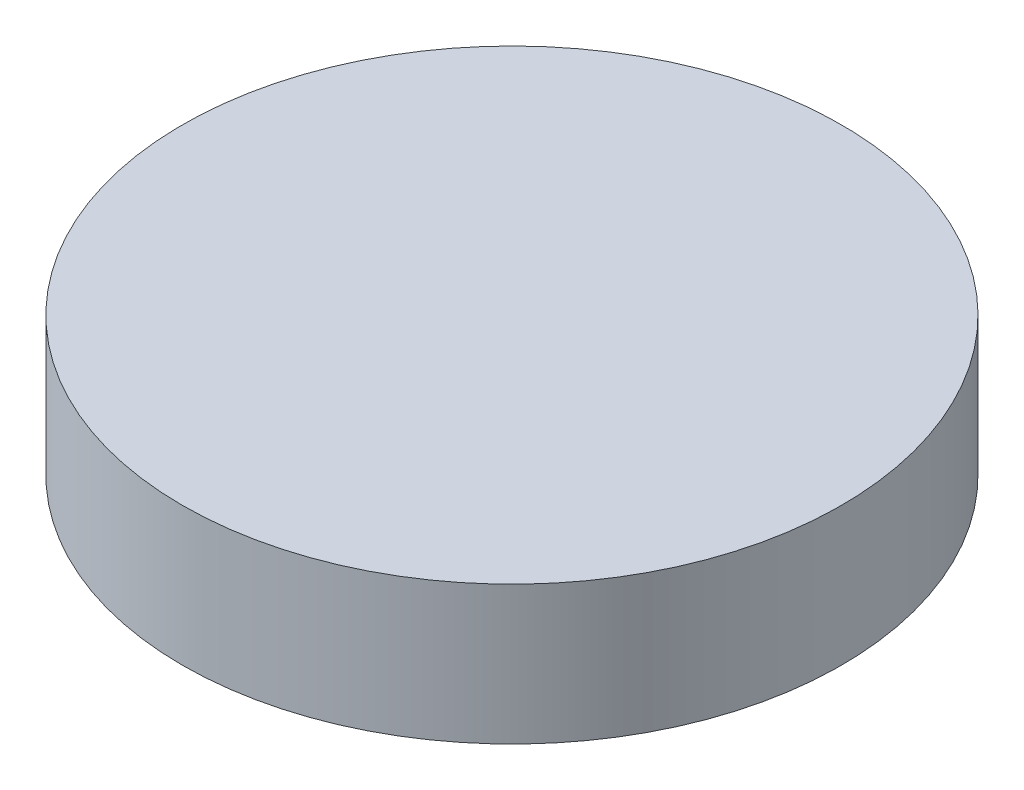
ISO-10303-21;
HEADER;
FILE_DESCRIPTION(('STEP AP214'),'2;1');
FILE_NAME('part.step','',(''),(''),'','','');
FILE_SCHEMA(('AUTOMOTIVE_DESIGN { 1 0 10303 214 1 1 1 1 }'));
ENDSEC;
DATA;
#1=APPLICATION_CONTEXT('core data for automotive mechanical design processes');
#2=APPLICATION_PROTOCOL_DEFINITION('international standard','automotive_design',2000,#1);
#3=PRODUCT_CONTEXT('',#1,'mechanical');
#4=PRODUCT('Part','Part','',(#3));
#5=PRODUCT_RELATED_PRODUCT_CATEGORY('part','',(#4));
#6=PRODUCT_DEFINITION_FORMATION('','',#4);
#7=PRODUCT_DEFINITION_CONTEXT('part definition',#1,'design');
#8=PRODUCT_DEFINITION('design','',#6,#7);
#9=PRODUCT_DEFINITION_SHAPE('','',#8);
#10=(LENGTH_UNIT() NAMED_UNIT(*) SI_UNIT(.MILLI.,.METRE.));
#11=(NAMED_UNIT(*) PLANE_ANGLE_UNIT() SI_UNIT($,.RADIAN.));
#12=(NAMED_UNIT(*) SI_UNIT($,.STERADIAN.) SOLID_ANGLE_UNIT());
#13=UNCERTAINTY_MEASURE_WITH_UNIT(LENGTH_MEASURE(1.E-05),#10,'distance_accuracy_value','');
#14=(GEOMETRIC_REPRESENTATION_CONTEXT(3) GLOBAL_UNCERTAINTY_ASSIGNED_CONTEXT((#13)) GLOBAL_UNIT_ASSIGNED_CONTEXT((#10,
#11,#12)) REPRESENTATION_CONTEXT('',''));
#15=CARTESIAN_POINT('',(0.,0.,0.));
#16=DIRECTION('',(0.,0.,1.));
#17=DIRECTION('',(1.,0.,0.));
#18=AXIS2_PLACEMENT_3D('',#15,#16,#17);
#19=CARTESIAN_POINT('',(0.,3.175,0.));
#20=DIRECTION('',(0.,-1.,0.));
#21=DIRECTION('',(0.,0.,-1.));
#22=AXIS2_PLACEMENT_3D('',#19,#20,#21);
#23=CYLINDRICAL_SURFACE('',#22,7.5565);
#24=CARTESIAN_POINT('',(0.,3.175,0.));
#25=DIRECTION('',(0.,1.,0.));
#26=DIRECTION('',(0.,0.,1.));
#27=AXIS2_PLACEMENT_3D('',#24,#25,#26);
#28=CIRCLE('',#27,7.5565);
#29=CARTESIAN_POINT('',(0.,3.175,7.5565));
#30=VERTEX_POINT('',#29);
#31=EDGE_CURVE('E10',#30,#30,#28,.T.);
#32=ORIENTED_EDGE('',*,*,#31,.F.);
#33=EDGE_LOOP('',(#32));
#34=FACE_BOUND('',#33,.T.);
#35=CARTESIAN_POINT('',(0.,0.,0.));
#36=DIRECTION('',(0.,1.,0.));
#37=DIRECTION('',(0.,0.,1.));
#38=AXIS2_PLACEMENT_3D('',#35,#36,#37);
#39=CIRCLE('',#38,7.5565);
#40=CARTESIAN_POINT('',(0.,0.,7.5565));
#41=VERTEX_POINT('',#40);
#42=EDGE_CURVE('E38',#41,#41,#39,.T.);
#43=ORIENTED_EDGE('',*,*,#42,.T.);
#44=EDGE_LOOP('',(#43));
#45=FACE_BOUND('',#44,.T.);
#46=ADVANCED_FACE('F35',(#34,#45),#23,.T.);
#47=CARTESIAN_POINT('',(0.,3.175,0.));
#48=DIRECTION('',(0.,1.,0.));
#49=DIRECTION('',(0.,0.,1.));
#50=AXIS2_PLACEMENT_3D('',#47,#48,#49);
#51=PLANE('',#50);
#52=ORIENTED_EDGE('',*,*,#31,.T.);
#53=EDGE_LOOP('',(#52));
#54=FACE_BOUND('',#53,.T.);
#55=ADVANCED_FACE('F52',(#54),#51,.T.);
#56=CARTESIAN_POINT('',(0.,0.,0.));
#57=DIRECTION('',(0.,1.,0.));
#58=DIRECTION('',(0.,0.,1.));
#59=AXIS2_PLACEMENT_3D('',#56,#57,#58);
#60=PLANE('',#59);
#61=ORIENTED_EDGE('',*,*,#42,.F.);
#62=EDGE_LOOP('',(#61));
#63=FACE_BOUND('',#62,.T.);
#64=ADVANCED_FACE('F50',(#63),#60,.F.);
#65=CLOSED_SHELL('',(#46,#55,#64));
#66=MANIFOLD_SOLID_BREP('B2',#65);
#67=ADVANCED_BREP_SHAPE_REPRESENTATION('',(#18,#66),#14);
#68=SHAPE_DEFINITION_REPRESENTATION(#9,#67);
ENDSEC;
END-ISO-10303-21;
